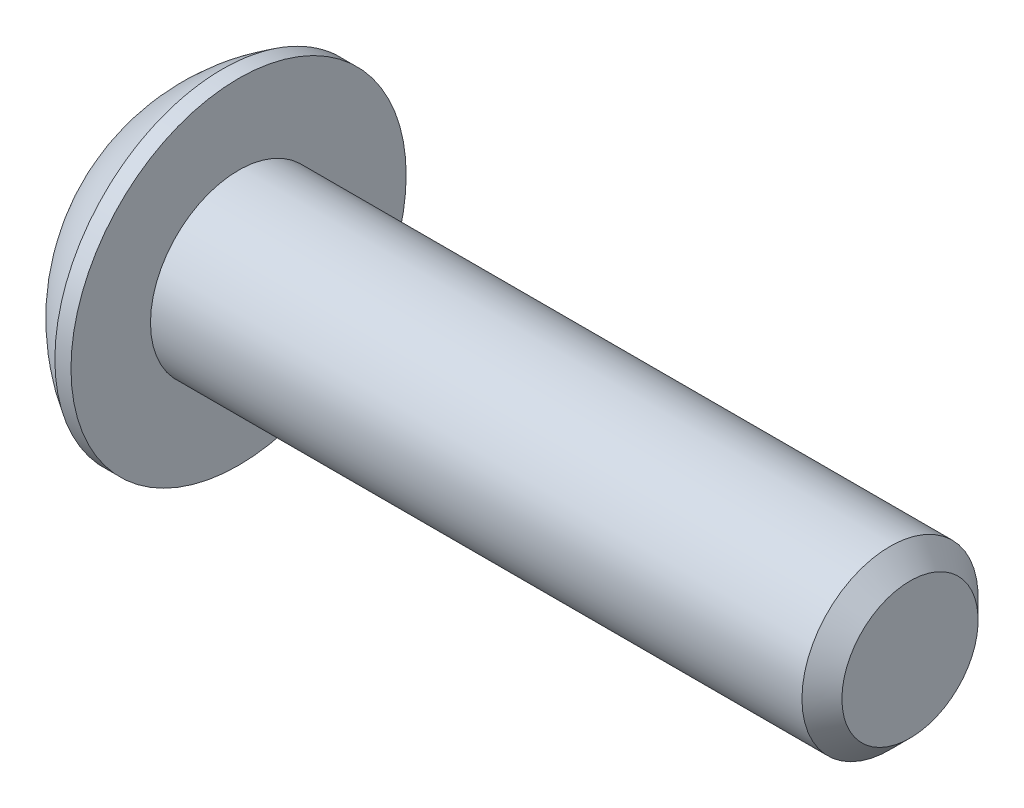
ISO-10303-21;
HEADER;
FILE_DESCRIPTION(('STEP AP214'),'2;1');
FILE_NAME('part.step','',(''),(''),'','','');
FILE_SCHEMA(('AUTOMOTIVE_DESIGN { 1 0 10303 214 1 1 1 1 }'));
ENDSEC;
DATA;
#1=APPLICATION_CONTEXT('core data for automotive mechanical design processes');
#2=APPLICATION_PROTOCOL_DEFINITION('international standard','automotive_design',2000,#1);
#3=PRODUCT_CONTEXT('',#1,'mechanical');
#4=PRODUCT('Part','Part','',(#3));
#5=PRODUCT_RELATED_PRODUCT_CATEGORY('part','',(#4));
#6=PRODUCT_DEFINITION_FORMATION('','',#4);
#7=PRODUCT_DEFINITION_CONTEXT('part definition',#1,'design');
#8=PRODUCT_DEFINITION('design','',#6,#7);
#9=PRODUCT_DEFINITION_SHAPE('','',#8);
#10=(LENGTH_UNIT() NAMED_UNIT(*) SI_UNIT(.MILLI.,.METRE.));
#11=(NAMED_UNIT(*) PLANE_ANGLE_UNIT() SI_UNIT($,.RADIAN.));
#12=(NAMED_UNIT(*) SI_UNIT($,.STERADIAN.) SOLID_ANGLE_UNIT());
#13=UNCERTAINTY_MEASURE_WITH_UNIT(LENGTH_MEASURE(1.E-05),#10,'distance_accuracy_value','');
#14=(GEOMETRIC_REPRESENTATION_CONTEXT(3) GLOBAL_UNCERTAINTY_ASSIGNED_CONTEXT((#13)) GLOBAL_UNIT_ASSIGNED_CONTEXT((#10,
#11,#12)) REPRESENTATION_CONTEXT('',''));
#15=CARTESIAN_POINT('',(0.,0.,0.));
#16=DIRECTION('',(0.,0.,1.));
#17=DIRECTION('',(1.,0.,0.));
#18=AXIS2_PLACEMENT_3D('',#15,#16,#17);
#19=CARTESIAN_POINT('',(1.32080000000034,0.,0.));
#20=DIRECTION('',(-1.,0.,0.));
#21=DIRECTION('',(0.,0.,1.));
#22=AXIS2_PLACEMENT_3D('',#19,#20,#21);
#23=CONICAL_SURFACE('',#22,1.1937999999998,1.04719755119608);
#24=CARTESIAN_POINT('',(2.01004075135902,0.,4.44089209850063E-13));
#25=VERTEX_POINT('',#24);
#26=VERTEX_LOOP('',#25);
#27=FACE_BOUND('',#26,.T.);
#28=CARTESIAN_POINT('',(1.32080000000009,0.,0.));
#29=DIRECTION('',(-1.,0.,0.));
#30=DIRECTION('',(0.,0.,1.));
#31=AXIS2_PLACEMENT_3D('',#28,#29,#30);
#32=CIRCLE('',#31,1.19380000000024);
#33=CARTESIAN_POINT('',(1.32080000000004,-1.03386112703797,0.59690000000006));
#34=VERTEX_POINT('',#33);
#35=CARTESIAN_POINT('',(1.32080000000004,0.,1.19380000000012));
#36=VERTEX_POINT('',#35);
#37=EDGE_CURVE('E20',#34,#36,#32,.T.);
#38=ORIENTED_EDGE('',*,*,#37,.T.);
#39=CARTESIAN_POINT('',(1.32080000000009,0.,0.));
#40=DIRECTION('',(-1.,0.,0.));
#41=DIRECTION('',(0.,0.,1.));
#42=AXIS2_PLACEMENT_3D('',#39,#40,#41);
#43=CIRCLE('',#42,1.19380000000024);
#44=CARTESIAN_POINT('',(1.32080000000004,1.03386112703797,0.596900000000061));
#45=VERTEX_POINT('',#44);
#46=EDGE_CURVE('E148',#36,#45,#43,.T.);
#47=ORIENTED_EDGE('',*,*,#46,.T.);
#48=CARTESIAN_POINT('',(1.32080000000009,0.,0.));
#49=DIRECTION('',(-1.,0.,0.));
#50=DIRECTION('',(0.,0.,1.));
#51=AXIS2_PLACEMENT_3D('',#48,#49,#50);
#52=CIRCLE('',#51,1.19380000000024);
#53=CARTESIAN_POINT('',(1.32080000000004,1.03386112703797,-0.596900000000061));
#54=VERTEX_POINT('',#53);
#55=EDGE_CURVE('E318',#45,#54,#52,.T.);
#56=ORIENTED_EDGE('',*,*,#55,.T.);
#57=CARTESIAN_POINT('',(1.32080000000009,0.,0.));
#58=DIRECTION('',(-1.,0.,0.));
#59=DIRECTION('',(0.,0.,1.));
#60=AXIS2_PLACEMENT_3D('',#57,#58,#59);
#61=CIRCLE('',#60,1.19380000000024);
#62=CARTESIAN_POINT('',(1.32080000000004,1.49457637585666E-12,-1.19380000000012));
#63=VERTEX_POINT('',#62);
#64=EDGE_CURVE('E319',#54,#63,#61,.T.);
#65=ORIENTED_EDGE('',*,*,#64,.T.);
#66=CARTESIAN_POINT('',(1.32080000000009,0.,0.));
#67=DIRECTION('',(-1.,0.,0.));
#68=DIRECTION('',(0.,0.,1.));
#69=AXIS2_PLACEMENT_3D('',#66,#67,#68);
#70=CIRCLE('',#69,1.19380000000024);
#71=CARTESIAN_POINT('',(1.32080000000004,-1.03386112703797,-0.59690000000006));
#72=VERTEX_POINT('',#71);
#73=EDGE_CURVE('E93',#63,#72,#70,.T.);
#74=ORIENTED_EDGE('',*,*,#73,.T.);
#75=CARTESIAN_POINT('',(1.32080000000009,0.,0.));
#76=DIRECTION('',(-1.,0.,0.));
#77=DIRECTION('',(0.,0.,1.));
#78=AXIS2_PLACEMENT_3D('',#75,#76,#77);
#79=CIRCLE('',#78,1.19380000000024);
#80=EDGE_CURVE('E89',#72,#34,#79,.T.);
#81=ORIENTED_EDGE('',*,*,#80,.T.);
#82=EDGE_LOOP('',(#38,#47,#56,#65,#74,#81));
#83=FACE_BOUND('',#82,.T.);
#84=ADVANCED_FACE('F17',(#27,#83),#23,.F.);
#85=CARTESIAN_POINT('',(1.3208,-2.06772225407572,-1.1938));
#86=DIRECTION('',(1.,0.,0.));
#87=DIRECTION('',(0.,0.,-1.));
#88=AXIS2_PLACEMENT_3D('',#85,#86,#87);
#89=PLANE('',#88);
#90=DIRECTION('',(0.,0.5,0.866025403784439));
#91=VECTOR('',#90,1.);
#92=CARTESIAN_POINT('',(1.3208,-1.37848150271715,0.));
#93=LINE('',#92,#91);
#94=CARTESIAN_POINT('',(1.3208,-0.689240751358574,1.1938));
#95=VERTEX_POINT('',#94);
#96=EDGE_CURVE('E101',#95,#34,#93,.F.);
#97=ORIENTED_EDGE('',*,*,#96,.F.);
#98=DIRECTION('',(0.,1.,0.));
#99=VECTOR('',#98,1.);
#100=CARTESIAN_POINT('',(1.3208,-0.689240751358574,1.1938));
#101=LINE('',#100,#99);
#102=EDGE_CURVE('E103',#36,#95,#101,.F.);
#103=ORIENTED_EDGE('',*,*,#102,.F.);
#104=ORIENTED_EDGE('',*,*,#37,.F.);
#105=EDGE_LOOP('',(#97,#103,#104));
#106=FACE_BOUND('',#105,.T.);
#107=ADVANCED_FACE('F99',(#106),#89,.F.);
#108=CARTESIAN_POINT('',(1.3208,-2.06772225407572,-1.1938));
#109=DIRECTION('',(1.,0.,0.));
#110=DIRECTION('',(0.,0.,-1.));
#111=AXIS2_PLACEMENT_3D('',#108,#109,#110);
#112=PLANE('',#111);
#113=DIRECTION('',(0.,-0.5,0.866025403784439));
#114=VECTOR('',#113,1.);
#115=CARTESIAN_POINT('',(1.3208,-0.689240751358574,-1.1938));
#116=LINE('',#115,#114);
#117=CARTESIAN_POINT('',(1.3208,-1.37848150271715,0.));
#118=VERTEX_POINT('',#117);
#119=EDGE_CURVE('E109',#118,#72,#116,.F.);
#120=ORIENTED_EDGE('',*,*,#119,.F.);
#121=DIRECTION('',(0.,0.5,0.866025403784439));
#122=VECTOR('',#121,1.);
#123=CARTESIAN_POINT('',(1.3208,-1.37848150271715,0.));
#124=LINE('',#123,#122);
#125=EDGE_CURVE('E106',#34,#118,#124,.F.);
#126=ORIENTED_EDGE('',*,*,#125,.F.);
#127=ORIENTED_EDGE('',*,*,#80,.F.);
#128=EDGE_LOOP('',(#120,#126,#127));
#129=FACE_BOUND('',#128,.T.);
#130=ADVANCED_FACE('F107',(#129),#112,.F.);
#131=CARTESIAN_POINT('',(1.3208,-2.06772225407572,-1.1938));
#132=DIRECTION('',(1.,0.,0.));
#133=DIRECTION('',(0.,0.,-1.));
#134=AXIS2_PLACEMENT_3D('',#131,#132,#133);
#135=PLANE('',#134);
#136=DIRECTION('',(0.,1.,0.));
#137=VECTOR('',#136,1.);
#138=CARTESIAN_POINT('',(1.3208,0.689240751358577,-1.1938));
#139=LINE('',#138,#137);
#140=CARTESIAN_POINT('',(1.3208,-0.689240751358574,-1.1938));
#141=VERTEX_POINT('',#140);
#142=EDGE_CURVE('E288',#141,#63,#139,.T.);
#143=ORIENTED_EDGE('',*,*,#142,.F.);
#144=DIRECTION('',(0.,-0.5,0.866025403784439));
#145=VECTOR('',#144,1.);
#146=CARTESIAN_POINT('',(1.3208,-0.689240751358574,-1.1938));
#147=LINE('',#146,#145);
#148=EDGE_CURVE('E300',#72,#141,#147,.F.);
#149=ORIENTED_EDGE('',*,*,#148,.F.);
#150=ORIENTED_EDGE('',*,*,#73,.F.);
#151=EDGE_LOOP('',(#143,#149,#150));
#152=FACE_BOUND('',#151,.T.);
#153=ADVANCED_FACE('F191',(#152),#135,.F.);
#154=CARTESIAN_POINT('',(1.3208,-2.06772225407572,-1.1938));
#155=DIRECTION('',(1.,0.,0.));
#156=DIRECTION('',(0.,0.,-1.));
#157=AXIS2_PLACEMENT_3D('',#154,#155,#156);
#158=PLANE('',#157);
#159=DIRECTION('',(0.,-0.5,-0.866025403784439));
#160=VECTOR('',#159,1.);
#161=CARTESIAN_POINT('',(1.3208,1.37848150271715,0.));
#162=LINE('',#161,#160);
#163=CARTESIAN_POINT('',(1.3208,0.689240751358577,-1.1938));
#164=VERTEX_POINT('',#163);
#165=EDGE_CURVE('E274',#164,#54,#162,.F.);
#166=ORIENTED_EDGE('',*,*,#165,.F.);
#167=DIRECTION('',(0.,1.,0.));
#168=VECTOR('',#167,1.);
#169=CARTESIAN_POINT('',(1.3208,0.689240751358577,-1.1938));
#170=LINE('',#169,#168);
#171=EDGE_CURVE('E285',#63,#164,#170,.T.);
#172=ORIENTED_EDGE('',*,*,#171,.F.);
#173=ORIENTED_EDGE('',*,*,#64,.F.);
#174=EDGE_LOOP('',(#166,#172,#173));
#175=FACE_BOUND('',#174,.T.);
#176=ADVANCED_FACE('F187',(#175),#158,.F.);
#177=CARTESIAN_POINT('',(1.3208,-2.06772225407572,-1.1938));
#178=DIRECTION('',(1.,0.,0.));
#179=DIRECTION('',(0.,0.,-1.));
#180=AXIS2_PLACEMENT_3D('',#177,#178,#179);
#181=PLANE('',#180);
#182=DIRECTION('',(0.,0.5,-0.866025403784439));
#183=VECTOR('',#182,1.);
#184=CARTESIAN_POINT('',(1.3208,0.689240751358576,1.1938));
#185=LINE('',#184,#183);
#186=CARTESIAN_POINT('',(1.3208,1.37848150271715,0.));
#187=VERTEX_POINT('',#186);
#188=EDGE_CURVE('E253',#187,#45,#185,.F.);
#189=ORIENTED_EDGE('',*,*,#188,.F.);
#190=DIRECTION('',(0.,-0.5,-0.866025403784439));
#191=VECTOR('',#190,1.);
#192=CARTESIAN_POINT('',(1.3208,1.37848150271715,0.));
#193=LINE('',#192,#191);
#194=EDGE_CURVE('E272',#54,#187,#193,.F.);
#195=ORIENTED_EDGE('',*,*,#194,.F.);
#196=ORIENTED_EDGE('',*,*,#55,.F.);
#197=EDGE_LOOP('',(#189,#195,#196));
#198=FACE_BOUND('',#197,.T.);
#199=ADVANCED_FACE('F183',(#198),#181,.F.);
#200=CARTESIAN_POINT('',(1.3208,-2.06772225407572,-1.1938));
#201=DIRECTION('',(1.,0.,0.));
#202=DIRECTION('',(0.,0.,-1.));
#203=AXIS2_PLACEMENT_3D('',#200,#201,#202);
#204=PLANE('',#203);
#205=DIRECTION('',(0.,1.,0.));
#206=VECTOR('',#205,1.);
#207=CARTESIAN_POINT('',(1.3208,-0.689240751358574,1.1938));
#208=LINE('',#207,#206);
#209=CARTESIAN_POINT('',(1.3208,0.689240751358576,1.1938));
#210=VERTEX_POINT('',#209);
#211=EDGE_CURVE('E118',#210,#36,#208,.F.);
#212=ORIENTED_EDGE('',*,*,#211,.F.);
#213=DIRECTION('',(0.,0.5,-0.866025403784439));
#214=VECTOR('',#213,1.);
#215=CARTESIAN_POINT('',(1.3208,0.689240751358576,1.1938));
#216=LINE('',#215,#214);
#217=EDGE_CURVE('E256',#45,#210,#216,.F.);
#218=ORIENTED_EDGE('',*,*,#217,.F.);
#219=ORIENTED_EDGE('',*,*,#46,.F.);
#220=EDGE_LOOP('',(#212,#218,#219));
#221=FACE_BOUND('',#220,.T.);
#222=ADVANCED_FACE('F179',(#221),#204,.F.);
#223=CARTESIAN_POINT('',(1.3208,-0.689240751358574,1.1938));
#224=DIRECTION('',(0.,0.,-1.));
#225=DIRECTION('',(0.,1.,0.));
#226=AXIS2_PLACEMENT_3D('',#223,#224,#225);
#227=PLANE('',#226);
#228=DIRECTION('',(0.,1.,0.));
#229=VECTOR('',#228,1.);
#230=CARTESIAN_POINT('',(0.,0.,1.1938));
#231=LINE('',#230,#229);
#232=CARTESIAN_POINT('',(0.,0.689240751358577,1.1938));
#233=VERTEX_POINT('',#232);
#234=CARTESIAN_POINT('',(0.,-0.689240751358574,1.1938));
#235=VERTEX_POINT('',#234);
#236=EDGE_CURVE('E250',#233,#235,#231,.F.);
#237=ORIENTED_EDGE('',*,*,#236,.F.);
#238=DIRECTION('',(1.,0.,0.));
#239=VECTOR('',#238,1.);
#240=CARTESIAN_POINT('',(1.3208,0.689240751358576,1.1938));
#241=LINE('',#240,#239);
#242=EDGE_CURVE('E262',#210,#233,#241,.F.);
#243=ORIENTED_EDGE('',*,*,#242,.F.);
#244=ORIENTED_EDGE('',*,*,#211,.T.);
#245=ORIENTED_EDGE('',*,*,#102,.T.);
#246=DIRECTION('',(1.,0.,0.));
#247=VECTOR('',#246,1.);
#248=CARTESIAN_POINT('',(1.3208,-0.689240751358574,1.1938));
#249=LINE('',#248,#247);
#250=EDGE_CURVE('E112',#235,#95,#249,.T.);
#251=ORIENTED_EDGE('',*,*,#250,.F.);
#252=EDGE_LOOP('',(#237,#243,#244,#245,#251));
#253=FACE_BOUND('',#252,.T.);
#254=ADVANCED_FACE('F176',(#253),#227,.T.);
#255=CARTESIAN_POINT('',(1.3208,-1.37848150271715,0.));
#256=DIRECTION('',(0.,0.866025403784439,-0.5));
#257=DIRECTION('',(0.,0.5,0.866025403784439));
#258=AXIS2_PLACEMENT_3D('',#255,#256,#257);
#259=PLANE('',#258);
#260=DIRECTION('',(0.,-0.5,-0.866025403784439));
#261=VECTOR('',#260,1.);
#262=CARTESIAN_POINT('',(0.,-0.689240751358574,1.1938));
#263=LINE('',#262,#261);
#264=CARTESIAN_POINT('',(0.,-1.37848150271715,0.));
#265=VERTEX_POINT('',#264);
#266=EDGE_CURVE('E247',#235,#265,#263,.T.);
#267=ORIENTED_EDGE('',*,*,#266,.F.);
#268=ORIENTED_EDGE('',*,*,#250,.T.);
#269=ORIENTED_EDGE('',*,*,#96,.T.);
#270=ORIENTED_EDGE('',*,*,#125,.T.);
#271=DIRECTION('',(1.,0.,0.));
#272=VECTOR('',#271,1.);
#273=CARTESIAN_POINT('',(1.3208,-1.37848150271715,0.));
#274=LINE('',#273,#272);
#275=EDGE_CURVE('E297',#265,#118,#274,.T.);
#276=ORIENTED_EDGE('',*,*,#275,.F.);
#277=EDGE_LOOP('',(#267,#268,#269,#270,#276));
#278=FACE_BOUND('',#277,.T.);
#279=ADVANCED_FACE('F116',(#278),#259,.T.);
#280=CARTESIAN_POINT('',(1.3208,-0.689240751358574,-1.1938));
#281=DIRECTION('',(0.,0.866025403784439,0.5));
#282=DIRECTION('',(0.,-0.5,0.866025403784439));
#283=AXIS2_PLACEMENT_3D('',#280,#281,#282);
#284=PLANE('',#283);
#285=DIRECTION('',(0.,0.5,-0.866025403784439));
#286=VECTOR('',#285,1.);
#287=CARTESIAN_POINT('',(0.,-1.37848150271715,0.));
#288=LINE('',#287,#286);
#289=CARTESIAN_POINT('',(0.,-0.689240751358574,-1.1938));
#290=VERTEX_POINT('',#289);
#291=EDGE_CURVE('E244',#265,#290,#288,.T.);
#292=ORIENTED_EDGE('',*,*,#291,.F.);
#293=ORIENTED_EDGE('',*,*,#275,.T.);
#294=ORIENTED_EDGE('',*,*,#119,.T.);
#295=ORIENTED_EDGE('',*,*,#148,.T.);
#296=DIRECTION('',(1.,0.,0.));
#297=VECTOR('',#296,1.);
#298=CARTESIAN_POINT('',(1.3208,-0.689240751358574,-1.1938));
#299=LINE('',#298,#297);
#300=EDGE_CURVE('E282',#290,#141,#299,.T.);
#301=ORIENTED_EDGE('',*,*,#300,.F.);
#302=EDGE_LOOP('',(#292,#293,#294,#295,#301));
#303=FACE_BOUND('',#302,.T.);
#304=ADVANCED_FACE('F169',(#303),#284,.T.);
#305=CARTESIAN_POINT('',(1.3208,0.689240751358577,-1.1938));
#306=DIRECTION('',(0.,0.,1.));
#307=DIRECTION('',(1.,0.,0.));
#308=AXIS2_PLACEMENT_3D('',#305,#306,#307);
#309=PLANE('',#308);
#310=DIRECTION('',(0.,1.,0.));
#311=VECTOR('',#310,1.);
#312=CARTESIAN_POINT('',(0.,0.,-1.1938));
#313=LINE('',#312,#311);
#314=CARTESIAN_POINT('',(0.,0.689240751358577,-1.1938));
#315=VERTEX_POINT('',#314);
#316=EDGE_CURVE('E241',#290,#315,#313,.T.);
#317=ORIENTED_EDGE('',*,*,#316,.F.);
#318=ORIENTED_EDGE('',*,*,#300,.T.);
#319=ORIENTED_EDGE('',*,*,#142,.T.);
#320=ORIENTED_EDGE('',*,*,#171,.T.);
#321=DIRECTION('',(1.,0.,0.));
#322=VECTOR('',#321,1.);
#323=CARTESIAN_POINT('',(1.3208,0.689240751358577,-1.1938));
#324=LINE('',#323,#322);
#325=EDGE_CURVE('E257',#315,#164,#324,.T.);
#326=ORIENTED_EDGE('',*,*,#325,.F.);
#327=EDGE_LOOP('',(#317,#318,#319,#320,#326));
#328=FACE_BOUND('',#327,.T.);
#329=ADVANCED_FACE('F166',(#328),#309,.T.);
#330=CARTESIAN_POINT('',(1.3208,1.37848150271715,0.));
#331=DIRECTION('',(0.,-0.866025403784439,0.5));
#332=DIRECTION('',(0.,-0.5,-0.866025403784439));
#333=AXIS2_PLACEMENT_3D('',#330,#331,#332);
#334=PLANE('',#333);
#335=DIRECTION('',(0.,0.5,0.866025403784439));
#336=VECTOR('',#335,1.);
#337=CARTESIAN_POINT('',(0.,0.689240751358577,-1.1938));
#338=LINE('',#337,#336);
#339=CARTESIAN_POINT('',(0.,1.37848150271715,0.));
#340=VERTEX_POINT('',#339);
#341=EDGE_CURVE('E238',#315,#340,#338,.T.);
#342=ORIENTED_EDGE('',*,*,#341,.F.);
#343=ORIENTED_EDGE('',*,*,#325,.T.);
#344=ORIENTED_EDGE('',*,*,#165,.T.);
#345=ORIENTED_EDGE('',*,*,#194,.T.);
#346=DIRECTION('',(1.,0.,0.));
#347=VECTOR('',#346,1.);
#348=CARTESIAN_POINT('',(1.3208,1.37848150271715,0.));
#349=LINE('',#348,#347);
#350=EDGE_CURVE('E35',#340,#187,#349,.T.);
#351=ORIENTED_EDGE('',*,*,#350,.F.);
#352=EDGE_LOOP('',(#342,#343,#344,#345,#351));
#353=FACE_BOUND('',#352,.T.);
#354=ADVANCED_FACE('F162',(#353),#334,.T.);
#355=CARTESIAN_POINT('',(1.3208,0.689240751358576,1.1938));
#356=DIRECTION('',(0.,-0.866025403784439,-0.5));
#357=DIRECTION('',(0.,0.5,-0.866025403784439));
#358=AXIS2_PLACEMENT_3D('',#355,#356,#357);
#359=PLANE('',#358);
#360=DIRECTION('',(0.,-0.5,0.866025403784439));
#361=VECTOR('',#360,1.);
#362=CARTESIAN_POINT('',(0.,1.37848150271715,0.));
#363=LINE('',#362,#361);
#364=EDGE_CURVE('E147',#340,#233,#363,.T.);
#365=ORIENTED_EDGE('',*,*,#364,.F.);
#366=ORIENTED_EDGE('',*,*,#350,.T.);
#367=ORIENTED_EDGE('',*,*,#188,.T.);
#368=ORIENTED_EDGE('',*,*,#217,.T.);
#369=ORIENTED_EDGE('',*,*,#242,.T.);
#370=EDGE_LOOP('',(#365,#366,#367,#368,#369));
#371=FACE_BOUND('',#370,.T.);
#372=ADVANCED_FACE('F158',(#371),#359,.T.);
#373=CARTESIAN_POINT('',(0.,0.,0.));
#374=DIRECTION('',(-1.,0.,0.));
#375=DIRECTION('',(0.,0.,1.));
#376=AXIS2_PLACEMENT_3D('',#373,#374,#375);
#377=PLANE('',#376);
#378=ORIENTED_EDGE('',*,*,#341,.T.);
#379=ORIENTED_EDGE('',*,*,#364,.T.);
#380=ORIENTED_EDGE('',*,*,#236,.T.);
#381=ORIENTED_EDGE('',*,*,#266,.T.);
#382=ORIENTED_EDGE('',*,*,#291,.T.);
#383=ORIENTED_EDGE('',*,*,#316,.T.);
#384=EDGE_LOOP('',(#378,#379,#380,#381,#382,#383));
#385=FACE_BOUND('',#384,.T.);
#386=CARTESIAN_POINT('',(0.,1.9812,0.));
#387=CARTESIAN_POINT('',(0.,1.9811996664299,0.0556258831179428));
#388=CARTESIAN_POINT('',(0.,1.97885520380442,0.111261989398606));
#389=CARTESIAN_POINT('',(0.,1.96949260169541,0.222149719830458));
#390=CARTESIAN_POINT('',(0.,1.96247308239605,0.277401225602895));
#391=CARTESIAN_POINT('',(0.,1.94379192841038,0.387209508139747));
#392=CARTESIAN_POINT('',(-1.85325793235264E-13,1.93212292489526,0.441765039546365));
#393=CARTESIAN_POINT('',(1.86344214223505E-13,1.90422331175315,0.549729449347493));
#394=CARTESIAN_POINT('',(6.94543371897454E-13,1.88798900035338,0.603137359208869));
#395=CARTESIAN_POINT('',(1.15501975216981E-12,1.83266214476501,0.760839131321828));
#396=CARTESIAN_POINT('',(0.,1.78690023648845,0.862876433575429));
#397=CARTESIAN_POINT('',(0.,1.67887358150667,1.05780719540872));
#398=CARTESIAN_POINT('',(9.54193214892627E-13,1.6166082074585,1.15070030720801));
#399=CARTESIAN_POINT('',(5.94805591894675E-13,1.51224157140982,1.28116890915697));
#400=CARTESIAN_POINT('',(1.63221293851378E-13,1.4755970394354,1.32320451127026));
#401=CARTESIAN_POINT('',(-1.62196980336157E-13,1.39893832619713,1.40400288695709));
#402=CARTESIAN_POINT('',(0.,1.35892742784698,1.44276877695455));
#403=CARTESIAN_POINT('',(1.14362537325405E-13,1.23416504602197,1.55382272417904));
#404=CARTESIAN_POINT('',(0.,1.14466125559859,1.62089527952111));
#405=CARTESIAN_POINT('',(0.,0.955712144178167,1.7390221808118));
#406=CARTESIAN_POINT('',(0.,0.856267198233564,1.79007713076007));
#407=CARTESIAN_POINT('',(0.,0.650206345910843,1.87477637530954));
#408=CARTESIAN_POINT('',(0.,0.543590516134855,1.90842085586267));
#409=CARTESIAN_POINT('',(0.,0.326226155292018,1.95733039300656));
#410=CARTESIAN_POINT('',(0.,0.21547760215793,1.97259535144288));
#411=CARTESIAN_POINT('',(0.,-0.00701040587544639,1.98431697865418));
#412=CARTESIAN_POINT('',(0.,-0.118749860774734,1.98077364742917));
#413=CARTESIAN_POINT('',(0.,-0.340050178355485,1.95497485623825));
#414=CARTESIAN_POINT('',(0.,-0.449611052668255,1.93271949620218));
#415=CARTESIAN_POINT('',(0.,-0.663431110729174,1.87014138774523));
#416=CARTESIAN_POINT('',(0.,-0.76769023783852,1.82981844635272));
#417=CARTESIAN_POINT('',(0.,-0.968005760719347,1.73219968377096));
#418=CARTESIAN_POINT('',(0.,-1.0640618469811,1.6749032225164));
#419=CARTESIAN_POINT('',(0.,-1.19980276751283,1.57757371205873));
#420=CARTESIAN_POINT('',(0.,-1.24366557129213,1.54322665019466));
#421=CARTESIAN_POINT('',(0.,-1.32838995706696,1.47093063174264));
#422=CARTESIAN_POINT('',(0.,-1.36924860178706,1.43297823102439));
#423=CARTESIAN_POINT('',(0.,-1.48674671849223,1.31419842051173));
#424=CARTESIAN_POINT('',(0.,-1.55842832343237,1.22836221289311));
#425=CARTESIAN_POINT('',(0.,-1.6863396856475,1.04586168272493));
#426=CARTESIAN_POINT('',(0.,-1.7425700302488,0.949197771949774));
#427=CARTESIAN_POINT('',(0.,-1.8141614250401,0.798182600298684));
#428=CARTESIAN_POINT('',(0.,-1.83591780585875,0.746776203847791));
#429=CARTESIAN_POINT('',(0.,-1.87500754181092,0.642341081688636));
#430=CARTESIAN_POINT('',(0.,-1.89234447645404,0.589313708122847));
#431=CARTESIAN_POINT('',(0.,-1.92246053433554,0.482076273028395));
#432=CARTESIAN_POINT('',(0.,-1.93524685475118,0.42786822425751));
#433=CARTESIAN_POINT('',(0.,-1.95620937250494,0.318578151844611));
#434=CARTESIAN_POINT('',(0.,-1.96438692958147,0.263496390912872));
#435=CARTESIAN_POINT('',(0.,-1.97388528284653,0.173607715038558));
#436=CARTESIAN_POINT('',(0.,-1.97662743364426,0.138944718024998));
#437=CARTESIAN_POINT('',(0.,-1.98028489645283,0.0695224782567002));
#438=CARTESIAN_POINT('',(0.,-1.98120020846367,0.0347632355019631));
#439=CARTESIAN_POINT('',(0.,-1.9811996664299,-0.0556258831179437));
#440=CARTESIAN_POINT('',(0.,-1.97885520380442,-0.111261989398607));
#441=CARTESIAN_POINT('',(0.,-1.96949260169541,-0.222149719830459));
#442=CARTESIAN_POINT('',(0.,-1.96247308239605,-0.277401225602897));
#443=CARTESIAN_POINT('',(0.,-1.94379192841039,-0.387209508139749));
#444=CARTESIAN_POINT('',(-1.85269749640691E-13,-1.93212292489526,-0.441765039546367));
#445=CARTESIAN_POINT('',(1.86288125054388E-13,-1.90422331175315,-0.549729449347495));
#446=CARTESIAN_POINT('',(6.94525090263764E-13,-1.88798900035338,-0.603137359208872));
#447=CARTESIAN_POINT('',(1.15505622829081E-12,-1.83266214476501,-0.760839131321831));
#448=CARTESIAN_POINT('',(0.,-1.78690023648845,-0.862876433575431));
#449=CARTESIAN_POINT('',(0.,-1.67887358150667,-1.05780719540872));
#450=CARTESIAN_POINT('',(9.54248812869379E-13,-1.6166082074585,-1.15070030720801));
#451=CARTESIAN_POINT('',(5.94777756479239E-13,-1.51224157140982,-1.28116890915698));
#452=CARTESIAN_POINT('',(1.63138949183833E-13,-1.47559703943539,-1.32320451127027));
#453=CARTESIAN_POINT('',(-1.62114715061273E-13,-1.39893832619713,-1.40400288695709));
#454=CARTESIAN_POINT('',(0.,-1.35892742784699,-1.44276877695455));
#455=CARTESIAN_POINT('',(1.13760489124207E-13,-1.23416504602197,-1.55382272417904));
#456=CARTESIAN_POINT('',(0.,-1.14466125559859,-1.62089527952111));
#457=CARTESIAN_POINT('',(0.,-0.95571214417816,-1.73902218081179));
#458=CARTESIAN_POINT('',(0.,-0.856267198233559,-1.79007713076007));
#459=CARTESIAN_POINT('',(0.,-0.650206345910841,-1.87477637530954));
#460=CARTESIAN_POINT('',(0.,-0.543590516134854,-1.90842085586267));
#461=CARTESIAN_POINT('',(0.,-0.326226155292018,-1.95733039300657));
#462=CARTESIAN_POINT('',(0.,-0.215477602157929,-1.97259535144288));
#463=CARTESIAN_POINT('',(0.,0.0070104058754487,-1.98431697865418));
#464=CARTESIAN_POINT('',(0.,0.118749860774737,-1.98077364742916));
#465=CARTESIAN_POINT('',(0.,0.340050178355489,-1.95497485623824));
#466=CARTESIAN_POINT('',(0.,0.44961105266826,-1.93271949620218));
#467=CARTESIAN_POINT('',(0.,0.663431110729178,-1.87014138774524));
#468=CARTESIAN_POINT('',(0.,0.767690237838524,-1.82981844635272));
#469=CARTESIAN_POINT('',(0.,0.968005760719348,-1.73219968377096));
#470=CARTESIAN_POINT('',(0.,1.0640618469811,-1.67490322251639));
#471=CARTESIAN_POINT('',(0.,1.19980276751283,-1.57757371205873));
#472=CARTESIAN_POINT('',(0.,1.24366557129214,-1.54322665019465));
#473=CARTESIAN_POINT('',(0.,1.32838995706696,-1.47093063174263));
#474=CARTESIAN_POINT('',(0.,1.36924860178706,-1.43297823102439));
#475=CARTESIAN_POINT('',(0.,1.48674671849223,-1.31419842051172));
#476=CARTESIAN_POINT('',(0.,1.55842832343237,-1.22836221289311));
#477=CARTESIAN_POINT('',(0.,1.6863396856475,-1.04586168272492));
#478=CARTESIAN_POINT('',(0.,1.7425700302488,-0.949197771949768));
#479=CARTESIAN_POINT('',(0.,1.8141614250401,-0.798182600298677));
#480=CARTESIAN_POINT('',(0.,1.83591780585875,-0.746776203847785));
#481=CARTESIAN_POINT('',(0.,1.87500754181092,-0.64234108168863));
#482=CARTESIAN_POINT('',(0.,1.89234447645404,-0.589313708122841));
#483=CARTESIAN_POINT('',(0.,1.92246053433555,-0.482076273028389));
#484=CARTESIAN_POINT('',(0.,1.93524685475118,-0.427868224257505));
#485=CARTESIAN_POINT('',(0.,1.95620937250494,-0.318578151844605));
#486=CARTESIAN_POINT('',(0.,1.96438692958147,-0.263496390912866));
#487=CARTESIAN_POINT('',(0.,1.97388528284653,-0.173607715038553));
#488=CARTESIAN_POINT('',(0.,1.97662743364426,-0.138944718024994));
#489=CARTESIAN_POINT('',(0.,1.98028489645283,-0.0695224782566989));
#490=CARTESIAN_POINT('',(0.,1.98120020846367,-0.034763235501963));
#491=CARTESIAN_POINT('',(0.,1.9812,0.));
#492=B_SPLINE_CURVE_WITH_KNOTS('',3,(#386,#387,#388,#389,#390,#391,#392,#393,#394,#395,#396,
#397,#398,#399,#400,#401,#402,#403,#404,#405,#406,#407,#408,#409,#410,#411,#412,#413,#414,#415,
#416,#417,#418,#419,#420,#421,#422,#423,#424,#425,#426,#427,#428,#429,#430,#431,#432,#433,#434,
#435,#436,#437,#438,#439,#440,#441,#442,#443,#444,#445,#446,#447,#448,#449,#450,#451,#452,#453,
#454,#455,#456,#457,#458,#459,#460,#461,#462,#463,#464,#465,#466,#467,#468,#469,#470,#471,#472,
#473,#474,#475,#476,#477,#478,#479,#480,#481,#482,#483,#484,#485,#486,#487,#488,#489,#490,#491),
.UNSPECIFIED.,.T.,.F.,(4,2,2,2,2,2,2,2,2,2,2,2,2,2,2,2,2,2,2,2,2,2,2,2,2,2,2,2,2,2,2,2,2,2,2,2,
2,2,2,2,2,2,2,2,2,2,2,2,2,2,2,2,4),(0.,0.166845646007828,0.333740557374255,0.500901034367693,
0.668197445942386,1.00199278686282,1.33580081809885,1.50292354032982,1.6698851310853,
2.00370118900129,2.33750465770544,2.67130456115909,3.005106247238,3.33890793331696,
3.67270783677065,4.00651130547476,4.34032736339026,4.50728895414554,4.67441167637632,
5.00821970761259,5.34201504853332,5.50931146010827,5.67647193710191,5.84336684846844,
6.0102124944764,6.11448220058334,6.21875190669029,6.38559755269812,6.55249246406454,
6.71965294105798,6.88694935263268,7.22074469355311,7.55455272478915,7.72167544702011,
7.88863703777559,8.22245309569158,8.55625656439573,8.89005646784938,9.2238581539283,
9.55765984000725,9.89145974346094,10.2252632121651,10.5590792700806,10.7260408608358,
10.8931635830666,11.2269716143029,11.5607669552236,11.7280633667986,11.8952238437922,
12.0621187551587,12.2289644011667,12.3332341072736,12.4375038133806),.UNSPECIFIED.);
#493=CARTESIAN_POINT('',(0.,1.9812,0.));
#494=VERTEX_POINT('',#493);
#495=EDGE_CURVE('E140',#494,#494,#492,.T.);
#496=ORIENTED_EDGE('',*,*,#495,.F.);
#497=EDGE_LOOP('',(#496));
#498=FACE_BOUND('',#497,.T.);
#499=ADVANCED_FACE('F154',(#385,#498),#377,.T.);
#500=CARTESIAN_POINT('',(4.13385,0.,0.));
#501=DIRECTION('',(0.,1.,0.));
#502=DIRECTION('',(1.,0.,0.));
#503=AXIS2_PLACEMENT_3D('',#500,#501,#502);
#504=SPHERICAL_SURFACE('',#503,4.58408870578439);
#505=CARTESIAN_POINT('',(1.8288,0.,0.));
#506=DIRECTION('',(-1.,0.,0.));
#507=DIRECTION('',(0.,0.,1.));
#508=AXIS2_PLACEMENT_3D('',#505,#506,#507);
#509=CIRCLE('',#508,3.9624);
#510=CARTESIAN_POINT('',(1.8288,0.,3.9624));
#511=VERTEX_POINT('',#510);
#512=EDGE_CURVE('E137',#511,#511,#509,.F.);
#513=ORIENTED_EDGE('',*,*,#512,.F.);
#514=EDGE_LOOP('',(#513));
#515=FACE_BOUND('',#514,.T.);
#516=ORIENTED_EDGE('',*,*,#495,.T.);
#517=EDGE_LOOP('',(#516));
#518=FACE_BOUND('',#517,.T.);
#519=ADVANCED_FACE('F150',(#515,#518),#504,.T.);
#520=CARTESIAN_POINT('',(18.0848,0.,0.));
#521=DIRECTION('',(-1.,0.,0.));
#522=DIRECTION('',(0.,0.,1.));
#523=AXIS2_PLACEMENT_3D('',#520,#521,#522);
#524=PLANE('',#523);
#525=CARTESIAN_POINT('',(18.0847999999969,0.,0.));
#526=DIRECTION('',(-1.,0.,0.));
#527=DIRECTION('',(0.,0.,1.));
#528=AXIS2_PLACEMENT_3D('',#525,#526,#527);
#529=CIRCLE('',#528,1.61036000002923);
#530=CARTESIAN_POINT('',(18.0847999999969,0.,1.61036000002923));
#531=VERTEX_POINT('',#530);
#532=EDGE_CURVE('E134',#531,#531,#529,.T.);
#533=ORIENTED_EDGE('',*,*,#532,.F.);
#534=EDGE_LOOP('',(#533));
#535=FACE_BOUND('',#534,.T.);
#536=ADVANCED_FACE('F222',(#535),#524,.F.);
#537=CARTESIAN_POINT('',(0.,0.,0.));
#538=DIRECTION('',(-1.,0.,0.));
#539=DIRECTION('',(0.,0.,1.));
#540=AXIS2_PLACEMENT_3D('',#537,#538,#539);
#541=CYLINDRICAL_SURFACE('',#540,3.9624);
#542=ORIENTED_EDGE('',*,*,#512,.T.);
#543=EDGE_LOOP('',(#542));
#544=FACE_BOUND('',#543,.T.);
#545=CARTESIAN_POINT('',(2.2098,0.,0.));
#546=DIRECTION('',(-1.,0.,0.));
#547=DIRECTION('',(0.,0.,1.));
#548=AXIS2_PLACEMENT_3D('',#545,#546,#547);
#549=CIRCLE('',#548,3.9624);
#550=CARTESIAN_POINT('',(2.2098,0.,3.9624));
#551=VERTEX_POINT('',#550);
#552=EDGE_CURVE('E131',#551,#551,#549,.T.);
#553=ORIENTED_EDGE('',*,*,#552,.T.);
#554=EDGE_LOOP('',(#553));
#555=FACE_BOUND('',#554,.T.);
#556=ADVANCED_FACE('F219',(#544,#555),#541,.T.);
#557=CARTESIAN_POINT('',(17.61235999993,0.,0.));
#558=DIRECTION('',(-1.,0.,0.));
#559=DIRECTION('',(0.,0.,1.));
#560=AXIS2_PLACEMENT_3D('',#557,#558,#559);
#561=CONICAL_SURFACE('',#560,2.08280000009609,0.785398163397448);
#562=ORIENTED_EDGE('',*,*,#532,.T.);
#563=EDGE_LOOP('',(#562));
#564=FACE_BOUND('',#563,.T.);
#565=CARTESIAN_POINT('',(17.61236,0.,0.));
#566=DIRECTION('',(-1.,0.,0.));
#567=DIRECTION('',(0.,0.,1.));
#568=AXIS2_PLACEMENT_3D('',#565,#566,#567);
#569=CIRCLE('',#568,2.0828);
#570=CARTESIAN_POINT('',(17.61236,0.,2.0828));
#571=VERTEX_POINT('',#570);
#572=EDGE_CURVE('E26',#571,#571,#569,.T.);
#573=ORIENTED_EDGE('',*,*,#572,.F.);
#574=EDGE_LOOP('',(#573));
#575=FACE_BOUND('',#574,.T.);
#576=ADVANCED_FACE('F211',(#564,#575),#561,.T.);
#577=CARTESIAN_POINT('',(2.2098,2.0828,0.));
#578=DIRECTION('',(-1.,0.,0.));
#579=DIRECTION('',(0.,0.,1.));
#580=AXIS2_PLACEMENT_3D('',#577,#578,#579);
#581=PLANE('',#580);
#582=CARTESIAN_POINT('',(2.2098,0.,0.));
#583=DIRECTION('',(-1.,0.,0.));
#584=DIRECTION('',(0.,0.,1.));
#585=AXIS2_PLACEMENT_3D('',#582,#583,#584);
#586=CIRCLE('',#585,2.0828);
#587=CARTESIAN_POINT('',(2.2098,0.,2.0828));
#588=VERTEX_POINT('',#587);
#589=EDGE_CURVE('E10',#588,#588,#586,.F.);
#590=ORIENTED_EDGE('',*,*,#589,.F.);
#591=EDGE_LOOP('',(#590));
#592=FACE_BOUND('',#591,.T.);
#593=ORIENTED_EDGE('',*,*,#552,.F.);
#594=EDGE_LOOP('',(#593));
#595=FACE_BOUND('',#594,.T.);
#596=ADVANCED_FACE('F205',(#592,#595),#581,.F.);
#597=CARTESIAN_POINT('',(0.,0.,0.));
#598=DIRECTION('',(-1.,0.,0.));
#599=DIRECTION('',(0.,0.,1.));
#600=AXIS2_PLACEMENT_3D('',#597,#598,#599);
#601=CYLINDRICAL_SURFACE('',#600,2.0828);
#602=ORIENTED_EDGE('',*,*,#572,.T.);
#603=EDGE_LOOP('',(#602));
#604=FACE_BOUND('',#603,.T.);
#605=ORIENTED_EDGE('',*,*,#589,.T.);
#606=EDGE_LOOP('',(#605));
#607=FACE_BOUND('',#606,.T.);
#608=ADVANCED_FACE('F203',(#604,#607),#601,.T.);
#609=CLOSED_SHELL('',(#84,#107,#130,#153,#176,#199,#222,#254,#279,#304,#329,#354,#372,#499,#519,
#536,#556,#576,#596,#608));
#610=MANIFOLD_SOLID_BREP('B1',#609);
#611=ADVANCED_BREP_SHAPE_REPRESENTATION('',(#18,#610),#14);
#612=SHAPE_DEFINITION_REPRESENTATION(#9,#611);
ENDSEC;
END-ISO-10303-21;
